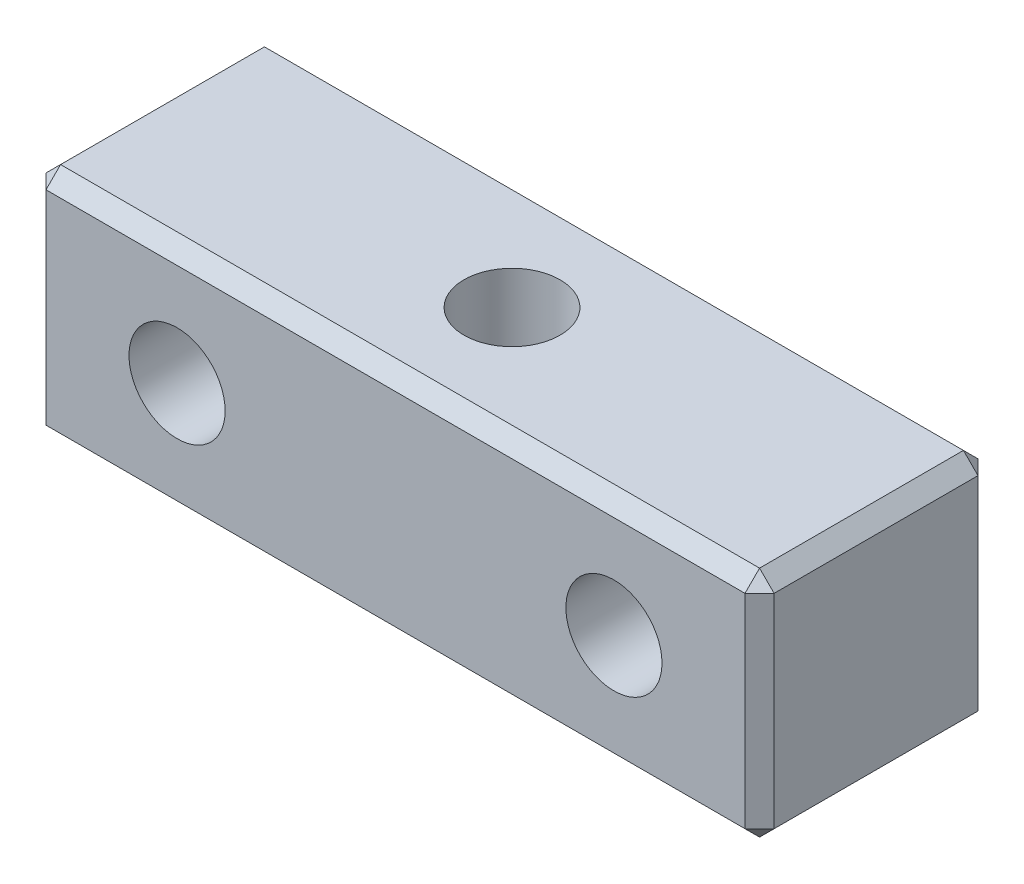
ISO-10303-21;
HEADER;
FILE_DESCRIPTION(('STEP AP214'),'2;1');
FILE_NAME('part.step','',(''),(''),'','','');
FILE_SCHEMA(('AUTOMOTIVE_DESIGN { 1 0 10303 214 1 1 1 1 }'));
ENDSEC;
DATA;
#1=APPLICATION_CONTEXT('core data for automotive mechanical design processes');
#2=APPLICATION_PROTOCOL_DEFINITION('international standard','automotive_design',2000,#1);
#3=PRODUCT_CONTEXT('',#1,'mechanical');
#4=PRODUCT('Part','Part','',(#3));
#5=PRODUCT_RELATED_PRODUCT_CATEGORY('part','',(#4));
#6=PRODUCT_DEFINITION_FORMATION('','',#4);
#7=PRODUCT_DEFINITION_CONTEXT('part definition',#1,'design');
#8=PRODUCT_DEFINITION('design','',#6,#7);
#9=PRODUCT_DEFINITION_SHAPE('','',#8);
#10=(LENGTH_UNIT() NAMED_UNIT(*) SI_UNIT(.MILLI.,.METRE.));
#11=(NAMED_UNIT(*) PLANE_ANGLE_UNIT() SI_UNIT($,.RADIAN.));
#12=(NAMED_UNIT(*) SI_UNIT($,.STERADIAN.) SOLID_ANGLE_UNIT());
#13=UNCERTAINTY_MEASURE_WITH_UNIT(LENGTH_MEASURE(1.E-05),#10,'distance_accuracy_value','');
#14=(GEOMETRIC_REPRESENTATION_CONTEXT(3) GLOBAL_UNCERTAINTY_ASSIGNED_CONTEXT((#13)) GLOBAL_UNIT_ASSIGNED_CONTEXT((#10,
#11,#12)) REPRESENTATION_CONTEXT('',''));
#15=CARTESIAN_POINT('',(0.,0.,0.));
#16=DIRECTION('',(0.,0.,1.));
#17=DIRECTION('',(1.,0.,0.));
#18=AXIS2_PLACEMENT_3D('',#15,#16,#17);
#19=CARTESIAN_POINT('',(12.5,-4.,8.));
#20=DIRECTION('',(-1.,0.,0.));
#21=DIRECTION('',(0.,0.,1.));
#22=AXIS2_PLACEMENT_3D('',#19,#20,#21);
#23=PLANE('',#22);
#24=DIRECTION('',(0.,0.,-1.));
#25=VECTOR('',#24,1.);
#26=CARTESIAN_POINT('',(12.5,-3.5,8.));
#27=LINE('',#26,#25);
#28=CARTESIAN_POINT('',(12.5,-3.5,7.5));
#29=VERTEX_POINT('',#28);
#30=CARTESIAN_POINT('',(12.5,-3.5,0.5));
#31=VERTEX_POINT('',#30);
#32=EDGE_CURVE('E186',#29,#31,#27,.T.);
#33=ORIENTED_EDGE('',*,*,#32,.T.);
#34=DIRECTION('',(0.,1.,0.));
#35=VECTOR('',#34,1.);
#36=CARTESIAN_POINT('',(12.5,4.,0.5));
#37=LINE('',#36,#35);
#38=CARTESIAN_POINT('',(12.5,3.5,0.5));
#39=VERTEX_POINT('',#38);
#40=EDGE_CURVE('E188',#31,#39,#37,.T.);
#41=ORIENTED_EDGE('',*,*,#40,.T.);
#42=DIRECTION('',(0.,0.,1.));
#43=VECTOR('',#42,1.);
#44=CARTESIAN_POINT('',(12.5,3.5,8.));
#45=LINE('',#44,#43);
#46=CARTESIAN_POINT('',(12.5,3.5,7.5));
#47=VERTEX_POINT('',#46);
#48=EDGE_CURVE('E182',#39,#47,#45,.T.);
#49=ORIENTED_EDGE('',*,*,#48,.T.);
#50=DIRECTION('',(0.,-1.,0.));
#51=VECTOR('',#50,1.);
#52=CARTESIAN_POINT('',(12.5,-4.,7.5));
#53=LINE('',#52,#51);
#54=EDGE_CURVE('E184',#47,#29,#53,.T.);
#55=ORIENTED_EDGE('',*,*,#54,.T.);
#56=EDGE_LOOP('',(#33,#41,#49,#55));
#57=FACE_BOUND('',#56,.T.);
#58=ADVANCED_FACE('F39',(#57),#23,.F.);
#59=CARTESIAN_POINT('',(-12.5,4.,8.));
#60=DIRECTION('',(0.,-1.,0.));
#61=DIRECTION('',(0.,0.,-1.));
#62=AXIS2_PLACEMENT_3D('',#59,#60,#61);
#63=PLANE('',#62);
#64=CARTESIAN_POINT('',(0.,4.,4.));
#65=DIRECTION('',(0.,-1.,0.));
#66=DIRECTION('',(0.,0.,-1.));
#67=AXIS2_PLACEMENT_3D('',#64,#65,#66);
#68=CIRCLE('',#67,1.65);
#69=CARTESIAN_POINT('',(0.,4.,2.35));
#70=VERTEX_POINT('',#69);
#71=EDGE_CURVE('E167',#70,#70,#68,.T.);
#72=ORIENTED_EDGE('',*,*,#71,.T.);
#73=EDGE_LOOP('',(#72));
#74=FACE_BOUND('',#73,.T.);
#75=DIRECTION('',(1.,0.,0.));
#76=VECTOR('',#75,1.);
#77=CARTESIAN_POINT('',(-12.5,4.,7.5));
#78=LINE('',#77,#76);
#79=CARTESIAN_POINT('',(-12.,4.,7.5));
#80=VERTEX_POINT('',#79);
#81=CARTESIAN_POINT('',(12.,4.,7.5));
#82=VERTEX_POINT('',#81);
#83=EDGE_CURVE('E49',#80,#82,#78,.T.);
#84=ORIENTED_EDGE('',*,*,#83,.T.);
#85=DIRECTION('',(0.,0.,-1.));
#86=VECTOR('',#85,1.);
#87=CARTESIAN_POINT('',(12.,4.,8.));
#88=LINE('',#87,#86);
#89=CARTESIAN_POINT('',(12.,4.,0.5));
#90=VERTEX_POINT('',#89);
#91=EDGE_CURVE('E11',#82,#90,#88,.T.);
#92=ORIENTED_EDGE('',*,*,#91,.T.);
#93=DIRECTION('',(-1.,0.,0.));
#94=VECTOR('',#93,1.);
#95=CARTESIAN_POINT('',(-12.5,4.,0.5));
#96=LINE('',#95,#94);
#97=CARTESIAN_POINT('',(-12.,4.,0.5));
#98=VERTEX_POINT('',#97);
#99=EDGE_CURVE('E208',#90,#98,#96,.T.);
#100=ORIENTED_EDGE('',*,*,#99,.T.);
#101=DIRECTION('',(0.,0.,1.));
#102=VECTOR('',#101,1.);
#103=CARTESIAN_POINT('',(-12.,4.,8.));
#104=LINE('',#103,#102);
#105=EDGE_CURVE('E60',#98,#80,#104,.T.);
#106=ORIENTED_EDGE('',*,*,#105,.T.);
#107=EDGE_LOOP('',(#84,#92,#100,#106));
#108=FACE_BOUND('',#107,.T.);
#109=ADVANCED_FACE('F321',(#74,#108),#63,.F.);
#110=CARTESIAN_POINT('',(-12.5,-4.,8.));
#111=DIRECTION('',(1.,0.,0.));
#112=DIRECTION('',(0.,0.,-1.));
#113=AXIS2_PLACEMENT_3D('',#110,#111,#112);
#114=PLANE('',#113);
#115=DIRECTION('',(0.,0.,-1.));
#116=VECTOR('',#115,1.);
#117=CARTESIAN_POINT('',(-12.5,3.5,8.));
#118=LINE('',#117,#116);
#119=CARTESIAN_POINT('',(-12.5,3.5,7.5));
#120=VERTEX_POINT('',#119);
#121=CARTESIAN_POINT('',(-12.5,3.5,0.5));
#122=VERTEX_POINT('',#121);
#123=EDGE_CURVE('E132',#120,#122,#118,.T.);
#124=ORIENTED_EDGE('',*,*,#123,.T.);
#125=DIRECTION('',(0.,-1.,0.));
#126=VECTOR('',#125,1.);
#127=CARTESIAN_POINT('',(-12.5,-4.,0.5));
#128=LINE('',#127,#126);
#129=CARTESIAN_POINT('',(-12.5,-3.5,0.5));
#130=VERTEX_POINT('',#129);
#131=EDGE_CURVE('E171',#122,#130,#128,.T.);
#132=ORIENTED_EDGE('',*,*,#131,.T.);
#133=DIRECTION('',(0.,0.,1.));
#134=VECTOR('',#133,1.);
#135=CARTESIAN_POINT('',(-12.5,-3.5,8.));
#136=LINE('',#135,#134);
#137=CARTESIAN_POINT('',(-12.5,-3.5,7.5));
#138=VERTEX_POINT('',#137);
#139=EDGE_CURVE('E135',#130,#138,#136,.T.);
#140=ORIENTED_EDGE('',*,*,#139,.T.);
#141=DIRECTION('',(0.,1.,0.));
#142=VECTOR('',#141,1.);
#143=CARTESIAN_POINT('',(-12.5,-4.,7.5));
#144=LINE('',#143,#142);
#145=EDGE_CURVE('E127',#138,#120,#144,.T.);
#146=ORIENTED_EDGE('',*,*,#145,.T.);
#147=EDGE_LOOP('',(#124,#132,#140,#146));
#148=FACE_BOUND('',#147,.T.);
#149=ADVANCED_FACE('F129',(#148),#114,.F.);
#150=CARTESIAN_POINT('',(-12.5,-4.,8.));
#151=DIRECTION('',(0.,1.,0.));
#152=DIRECTION('',(0.,0.,1.));
#153=AXIS2_PLACEMENT_3D('',#150,#151,#152);
#154=PLANE('',#153);
#155=CARTESIAN_POINT('',(0.,-4.,4.));
#156=DIRECTION('',(0.,-1.,0.));
#157=DIRECTION('',(0.,0.,-1.));
#158=AXIS2_PLACEMENT_3D('',#155,#156,#157);
#159=CIRCLE('',#158,1.64999999999999);
#160=CARTESIAN_POINT('',(0.,-4.,2.35000000000001));
#161=VERTEX_POINT('',#160);
#162=EDGE_CURVE('E638',#161,#161,#159,.T.);
#163=ORIENTED_EDGE('',*,*,#162,.F.);
#164=EDGE_LOOP('',(#163));
#165=FACE_BOUND('',#164,.T.);
#166=DIRECTION('',(-1.,0.,0.));
#167=VECTOR('',#166,1.);
#168=CARTESIAN_POINT('',(-12.5,-4.,7.5));
#169=LINE('',#168,#167);
#170=CARTESIAN_POINT('',(12.,-4.,7.5));
#171=VERTEX_POINT('',#170);
#172=CARTESIAN_POINT('',(-12.,-4.,7.5));
#173=VERTEX_POINT('',#172);
#174=EDGE_CURVE('E191',#171,#173,#169,.T.);
#175=ORIENTED_EDGE('',*,*,#174,.T.);
#176=DIRECTION('',(0.,0.,-1.));
#177=VECTOR('',#176,1.);
#178=CARTESIAN_POINT('',(-12.,-4.,8.));
#179=LINE('',#178,#177);
#180=CARTESIAN_POINT('',(-12.,-4.,0.5));
#181=VERTEX_POINT('',#180);
#182=EDGE_CURVE('E197',#173,#181,#179,.T.);
#183=ORIENTED_EDGE('',*,*,#182,.T.);
#184=DIRECTION('',(1.,0.,0.));
#185=VECTOR('',#184,1.);
#186=CARTESIAN_POINT('',(12.5,-4.,0.5));
#187=LINE('',#186,#185);
#188=CARTESIAN_POINT('',(12.,-4.,0.5));
#189=VERTEX_POINT('',#188);
#190=EDGE_CURVE('E195',#181,#189,#187,.T.);
#191=ORIENTED_EDGE('',*,*,#190,.T.);
#192=DIRECTION('',(0.,0.,1.));
#193=VECTOR('',#192,1.);
#194=CARTESIAN_POINT('',(12.,-4.,8.));
#195=LINE('',#194,#193);
#196=EDGE_CURVE('E193',#189,#171,#195,.T.);
#197=ORIENTED_EDGE('',*,*,#196,.T.);
#198=EDGE_LOOP('',(#175,#183,#191,#197));
#199=FACE_BOUND('',#198,.T.);
#200=ADVANCED_FACE('F285',(#165,#199),#154,.F.);
#201=CARTESIAN_POINT('',(0.,0.,8.));
#202=DIRECTION('',(0.,0.,-1.));
#203=DIRECTION('',(-1.,0.,0.));
#204=AXIS2_PLACEMENT_3D('',#201,#202,#203);
#205=PLANE('',#204);
#206=CARTESIAN_POINT('',(-7.5,0.,8.));
#207=DIRECTION('',(0.,0.,1.));
#208=DIRECTION('',(1.,0.,0.));
#209=AXIS2_PLACEMENT_3D('',#206,#207,#208);
#210=CIRCLE('',#209,1.64999999999999);
#211=CARTESIAN_POINT('',(-5.85000000000001,0.,8.));
#212=VERTEX_POINT('',#211);
#213=EDGE_CURVE('E648',#212,#212,#210,.T.);
#214=ORIENTED_EDGE('',*,*,#213,.F.);
#215=EDGE_LOOP('',(#214));
#216=FACE_BOUND('',#215,.T.);
#217=CARTESIAN_POINT('',(7.5,0.,8.));
#218=DIRECTION('',(0.,0.,1.));
#219=DIRECTION('',(1.,0.,0.));
#220=AXIS2_PLACEMENT_3D('',#217,#218,#219);
#221=CIRCLE('',#220,1.64999999999999);
#222=CARTESIAN_POINT('',(9.14999999999999,0.,8.));
#223=VERTEX_POINT('',#222);
#224=EDGE_CURVE('E641',#223,#223,#221,.T.);
#225=ORIENTED_EDGE('',*,*,#224,.F.);
#226=EDGE_LOOP('',(#225));
#227=FACE_BOUND('',#226,.T.);
#228=DIRECTION('',(0.,-1.,0.));
#229=VECTOR('',#228,1.);
#230=CARTESIAN_POINT('',(-12.,0.,8.));
#231=LINE('',#230,#229);
#232=CARTESIAN_POINT('',(-12.,3.5,8.));
#233=VERTEX_POINT('',#232);
#234=CARTESIAN_POINT('',(-12.,-3.5,8.));
#235=VERTEX_POINT('',#234);
#236=EDGE_CURVE('E145',#233,#235,#231,.T.);
#237=ORIENTED_EDGE('',*,*,#236,.T.);
#238=DIRECTION('',(1.,0.,0.));
#239=VECTOR('',#238,1.);
#240=CARTESIAN_POINT('',(0.,-3.5,8.));
#241=LINE('',#240,#239);
#242=CARTESIAN_POINT('',(12.,-3.5,8.));
#243=VERTEX_POINT('',#242);
#244=EDGE_CURVE('E205',#235,#243,#241,.T.);
#245=ORIENTED_EDGE('',*,*,#244,.T.);
#246=DIRECTION('',(0.,1.,0.));
#247=VECTOR('',#246,1.);
#248=CARTESIAN_POINT('',(12.,0.,8.));
#249=LINE('',#248,#247);
#250=CARTESIAN_POINT('',(12.,3.5,8.));
#251=VERTEX_POINT('',#250);
#252=EDGE_CURVE('E202',#243,#251,#249,.T.);
#253=ORIENTED_EDGE('',*,*,#252,.T.);
#254=DIRECTION('',(-1.,0.,0.));
#255=VECTOR('',#254,1.);
#256=CARTESIAN_POINT('',(0.,3.5,8.));
#257=LINE('',#256,#255);
#258=EDGE_CURVE('E200',#251,#233,#257,.T.);
#259=ORIENTED_EDGE('',*,*,#258,.T.);
#260=EDGE_LOOP('',(#237,#245,#253,#259));
#261=FACE_BOUND('',#260,.T.);
#262=ADVANCED_FACE('F272',(#216,#227,#261),#205,.F.);
#263=CARTESIAN_POINT('',(0.,0.,0.));
#264=DIRECTION('',(0.,0.,-1.));
#265=DIRECTION('',(-1.,0.,0.));
#266=AXIS2_PLACEMENT_3D('',#263,#264,#265);
#267=PLANE('',#266);
#268=CARTESIAN_POINT('',(-7.5,0.,0.));
#269=DIRECTION('',(0.,0.,1.));
#270=DIRECTION('',(1.,0.,0.));
#271=AXIS2_PLACEMENT_3D('',#268,#269,#270);
#272=CIRCLE('',#271,1.65);
#273=CARTESIAN_POINT('',(-5.85,0.,0.));
#274=VERTEX_POINT('',#273);
#275=EDGE_CURVE('E646',#274,#274,#272,.T.);
#276=ORIENTED_EDGE('',*,*,#275,.T.);
#277=EDGE_LOOP('',(#276));
#278=FACE_BOUND('',#277,.T.);
#279=CARTESIAN_POINT('',(7.5,0.,0.));
#280=DIRECTION('',(0.,0.,1.));
#281=DIRECTION('',(1.,0.,0.));
#282=AXIS2_PLACEMENT_3D('',#279,#280,#281);
#283=CIRCLE('',#282,1.65);
#284=CARTESIAN_POINT('',(9.15,0.,0.));
#285=VERTEX_POINT('',#284);
#286=EDGE_CURVE('E639',#285,#285,#283,.T.);
#287=ORIENTED_EDGE('',*,*,#286,.T.);
#288=EDGE_LOOP('',(#287));
#289=FACE_BOUND('',#288,.T.);
#290=DIRECTION('',(0.,-1.,0.));
#291=VECTOR('',#290,1.);
#292=CARTESIAN_POINT('',(12.,-4.,0.));
#293=LINE('',#292,#291);
#294=CARTESIAN_POINT('',(12.,3.5,0.));
#295=VERTEX_POINT('',#294);
#296=CARTESIAN_POINT('',(12.,-3.5,0.));
#297=VERTEX_POINT('',#296);
#298=EDGE_CURVE('E175',#295,#297,#293,.T.);
#299=ORIENTED_EDGE('',*,*,#298,.T.);
#300=DIRECTION('',(-1.,0.,0.));
#301=VECTOR('',#300,1.);
#302=CARTESIAN_POINT('',(-12.5,-3.5,0.));
#303=LINE('',#302,#301);
#304=CARTESIAN_POINT('',(-12.,-3.5,0.));
#305=VERTEX_POINT('',#304);
#306=EDGE_CURVE('E180',#297,#305,#303,.T.);
#307=ORIENTED_EDGE('',*,*,#306,.T.);
#308=DIRECTION('',(0.,1.,0.));
#309=VECTOR('',#308,1.);
#310=CARTESIAN_POINT('',(-12.,4.,0.));
#311=LINE('',#310,#309);
#312=CARTESIAN_POINT('',(-12.,3.5,0.));
#313=VERTEX_POINT('',#312);
#314=EDGE_CURVE('E177',#305,#313,#311,.T.);
#315=ORIENTED_EDGE('',*,*,#314,.T.);
#316=DIRECTION('',(1.,0.,0.));
#317=VECTOR('',#316,1.);
#318=CARTESIAN_POINT('',(12.5,3.5,0.));
#319=LINE('',#318,#317);
#320=EDGE_CURVE('E173',#313,#295,#319,.T.);
#321=ORIENTED_EDGE('',*,*,#320,.T.);
#322=EDGE_LOOP('',(#299,#307,#315,#321));
#323=FACE_BOUND('',#322,.T.);
#324=ADVANCED_FACE('F435',(#278,#289,#323),#267,.T.);
#325=CARTESIAN_POINT('',(12.,0.,8.));
#326=DIRECTION('',(-0.70710678118655,0.,-0.707106781186545));
#327=DIRECTION('',(0.,1.,0.));
#328=AXIS2_PLACEMENT_3D('',#325,#326,#327);
#329=PLANE('',#328);
#330=DIRECTION('',(-0.707106781186545,0.,0.70710678118655));
#331=VECTOR('',#330,1.);
#332=CARTESIAN_POINT('',(12.,3.5,8.));
#333=LINE('',#332,#331);
#334=EDGE_CURVE('E44',#251,#47,#333,.F.);
#335=ORIENTED_EDGE('',*,*,#334,.F.);
#336=ORIENTED_EDGE('',*,*,#252,.F.);
#337=DIRECTION('',(0.707106781186545,0.,-0.70710678118655));
#338=VECTOR('',#337,1.);
#339=CARTESIAN_POINT('',(12.25,-3.5,7.75));
#340=LINE('',#339,#338);
#341=EDGE_CURVE('E165',#29,#243,#340,.F.);
#342=ORIENTED_EDGE('',*,*,#341,.F.);
#343=ORIENTED_EDGE('',*,*,#54,.F.);
#344=EDGE_LOOP('',(#335,#336,#342,#343));
#345=FACE_BOUND('',#344,.T.);
#346=ADVANCED_FACE('F42',(#345),#329,.F.);
#347=CARTESIAN_POINT('',(12.,3.5,8.));
#348=DIRECTION('',(0.57735026918963,0.577350269189622,0.577350269189626));
#349=DIRECTION('',(0.707106781186545,0.,-0.70710678118655));
#350=AXIS2_PLACEMENT_3D('',#347,#348,#349);
#351=PLANE('',#350);
#352=DIRECTION('',(0.,0.70710678118655,-0.707106781186545));
#353=VECTOR('',#352,1.);
#354=CARTESIAN_POINT('',(12.,3.5,8.));
#355=LINE('',#354,#353);
#356=EDGE_CURVE('E253',#251,#82,#355,.T.);
#357=ORIENTED_EDGE('',*,*,#356,.F.);
#358=ORIENTED_EDGE('',*,*,#334,.T.);
#359=DIRECTION('',(0.707106781186545,-0.70710678118655,0.));
#360=VECTOR('',#359,1.);
#361=CARTESIAN_POINT('',(12.25,3.75,7.5));
#362=LINE('',#361,#360);
#363=EDGE_CURVE('E255',#82,#47,#362,.T.);
#364=ORIENTED_EDGE('',*,*,#363,.F.);
#365=EDGE_LOOP('',(#357,#358,#364));
#366=FACE_BOUND('',#365,.T.);
#367=ADVANCED_FACE('F307',(#366),#351,.T.);
#368=CARTESIAN_POINT('',(12.,-4.,7.5));
#369=DIRECTION('',(0.577350269189626,-0.57735026918963,0.577350269189622));
#370=DIRECTION('',(0.70710678118655,0.707106781186545,0.));
#371=AXIS2_PLACEMENT_3D('',#368,#369,#370);
#372=PLANE('',#371);
#373=DIRECTION('',(-0.70710678118655,-0.707106781186545,0.));
#374=VECTOR('',#373,1.);
#375=CARTESIAN_POINT('',(12.,-4.,7.5));
#376=LINE('',#375,#374);
#377=EDGE_CURVE('E248',#29,#171,#376,.T.);
#378=ORIENTED_EDGE('',*,*,#377,.F.);
#379=ORIENTED_EDGE('',*,*,#341,.T.);
#380=DIRECTION('',(0.,0.707106781186545,0.70710678118655));
#381=VECTOR('',#380,1.);
#382=CARTESIAN_POINT('',(12.,-4.,7.5));
#383=LINE('',#382,#381);
#384=EDGE_CURVE('E251',#171,#243,#383,.T.);
#385=ORIENTED_EDGE('',*,*,#384,.F.);
#386=EDGE_LOOP('',(#378,#379,#385));
#387=FACE_BOUND('',#386,.T.);
#388=ADVANCED_FACE('F263',(#387),#372,.T.);
#389=CARTESIAN_POINT('',(12.,4.,8.));
#390=DIRECTION('',(-0.70710678118655,-0.707106781186545,0.));
#391=DIRECTION('',(0.,0.,-1.));
#392=AXIS2_PLACEMENT_3D('',#389,#390,#391);
#393=PLANE('',#392);
#394=ORIENTED_EDGE('',*,*,#363,.T.);
#395=ORIENTED_EDGE('',*,*,#48,.F.);
#396=DIRECTION('',(-0.707106781186545,0.70710678118655,0.));
#397=VECTOR('',#396,1.);
#398=CARTESIAN_POINT('',(12.5,3.5,0.5));
#399=LINE('',#398,#397);
#400=EDGE_CURVE('E243',#90,#39,#399,.F.);
#401=ORIENTED_EDGE('',*,*,#400,.F.);
#402=ORIENTED_EDGE('',*,*,#91,.F.);
#403=EDGE_LOOP('',(#394,#395,#401,#402));
#404=FACE_BOUND('',#403,.T.);
#405=ADVANCED_FACE('F303',(#404),#393,.F.);
#406=CARTESIAN_POINT('',(0.,3.5,8.));
#407=DIRECTION('',(0.,-0.707106781186545,-0.70710678118655));
#408=DIRECTION('',(-1.,0.,0.));
#409=AXIS2_PLACEMENT_3D('',#406,#407,#408);
#410=PLANE('',#409);
#411=ORIENTED_EDGE('',*,*,#356,.T.);
#412=ORIENTED_EDGE('',*,*,#83,.F.);
#413=DIRECTION('',(0.,-0.70710678118655,0.707106781186545));
#414=VECTOR('',#413,1.);
#415=CARTESIAN_POINT('',(-12.,3.75,7.75));
#416=LINE('',#415,#414);
#417=EDGE_CURVE('E149',#233,#80,#416,.F.);
#418=ORIENTED_EDGE('',*,*,#417,.F.);
#419=ORIENTED_EDGE('',*,*,#258,.F.);
#420=EDGE_LOOP('',(#411,#412,#418,#419));
#421=FACE_BOUND('',#420,.T.);
#422=ADVANCED_FACE('F310',(#421),#410,.F.);
#423=CARTESIAN_POINT('',(-12.,0.,8.));
#424=DIRECTION('',(0.70710678118655,0.,-0.707106781186545));
#425=DIRECTION('',(0.,-1.,0.));
#426=AXIS2_PLACEMENT_3D('',#423,#424,#425);
#427=PLANE('',#426);
#428=DIRECTION('',(0.707106781186545,0.,0.70710678118655));
#429=VECTOR('',#428,1.);
#430=CARTESIAN_POINT('',(-12.5,-3.5,7.5));
#431=LINE('',#430,#429);
#432=EDGE_CURVE('E150',#235,#138,#431,.F.);
#433=ORIENTED_EDGE('',*,*,#432,.F.);
#434=ORIENTED_EDGE('',*,*,#236,.F.);
#435=DIRECTION('',(-0.707106781186545,0.,-0.70710678118655));
#436=VECTOR('',#435,1.);
#437=CARTESIAN_POINT('',(-12.5,3.5,7.5));
#438=LINE('',#437,#436);
#439=EDGE_CURVE('E142',#120,#233,#438,.F.);
#440=ORIENTED_EDGE('',*,*,#439,.F.);
#441=ORIENTED_EDGE('',*,*,#145,.F.);
#442=EDGE_LOOP('',(#433,#434,#440,#441));
#443=FACE_BOUND('',#442,.T.);
#444=ADVANCED_FACE('F144',(#443),#427,.F.);
#445=CARTESIAN_POINT('',(0.,-3.5,8.));
#446=DIRECTION('',(0.,0.70710678118655,-0.707106781186545));
#447=DIRECTION('',(1.,0.,0.));
#448=AXIS2_PLACEMENT_3D('',#445,#446,#447);
#449=PLANE('',#448);
#450=ORIENTED_EDGE('',*,*,#384,.T.);
#451=ORIENTED_EDGE('',*,*,#244,.F.);
#452=DIRECTION('',(0.,-0.707106781186545,-0.70710678118655));
#453=VECTOR('',#452,1.);
#454=CARTESIAN_POINT('',(-12.,-3.75,7.75));
#455=LINE('',#454,#453);
#456=EDGE_CURVE('E238',#173,#235,#455,.F.);
#457=ORIENTED_EDGE('',*,*,#456,.F.);
#458=ORIENTED_EDGE('',*,*,#174,.F.);
#459=EDGE_LOOP('',(#450,#451,#457,#458));
#460=FACE_BOUND('',#459,.T.);
#461=ADVANCED_FACE('F275',(#460),#449,.F.);
#462=CARTESIAN_POINT('',(12.5,-3.5,8.));
#463=DIRECTION('',(-0.707106781186545,0.70710678118655,0.));
#464=DIRECTION('',(0.,0.,-1.));
#465=AXIS2_PLACEMENT_3D('',#462,#463,#464);
#466=PLANE('',#465);
#467=ORIENTED_EDGE('',*,*,#377,.T.);
#468=ORIENTED_EDGE('',*,*,#196,.F.);
#469=DIRECTION('',(0.70710678118655,0.707106781186545,0.));
#470=VECTOR('',#469,1.);
#471=CARTESIAN_POINT('',(12.25,-3.75,0.5));
#472=LINE('',#471,#470);
#473=EDGE_CURVE('E235',#31,#189,#472,.F.);
#474=ORIENTED_EDGE('',*,*,#473,.F.);
#475=ORIENTED_EDGE('',*,*,#32,.F.);
#476=EDGE_LOOP('',(#467,#468,#474,#475));
#477=FACE_BOUND('',#476,.T.);
#478=ADVANCED_FACE('F289',(#477),#466,.F.);
#479=CARTESIAN_POINT('',(12.5,-4.,0.5));
#480=DIRECTION('',(0.707106781186545,0.,-0.70710678118655));
#481=DIRECTION('',(0.,-1.,0.));
#482=AXIS2_PLACEMENT_3D('',#479,#480,#481);
#483=PLANE('',#482);
#484=DIRECTION('',(-0.70710678118655,0.,-0.707106781186545));
#485=VECTOR('',#484,1.);
#486=CARTESIAN_POINT('',(12.5,3.5,0.5));
#487=LINE('',#486,#485);
#488=EDGE_CURVE('E245',#39,#295,#487,.T.);
#489=ORIENTED_EDGE('',*,*,#488,.F.);
#490=ORIENTED_EDGE('',*,*,#40,.F.);
#491=DIRECTION('',(0.70710678118655,0.,0.707106781186545));
#492=VECTOR('',#491,1.);
#493=CARTESIAN_POINT('',(12.,-3.5,0.));
#494=LINE('',#493,#492);
#495=EDGE_CURVE('E232',#297,#31,#494,.T.);
#496=ORIENTED_EDGE('',*,*,#495,.F.);
#497=ORIENTED_EDGE('',*,*,#298,.F.);
#498=EDGE_LOOP('',(#489,#490,#496,#497));
#499=FACE_BOUND('',#498,.T.);
#500=ADVANCED_FACE('F295',(#499),#483,.T.);
#501=CARTESIAN_POINT('',(12.5,3.5,0.5));
#502=DIRECTION('',(0.577350269189626,0.577350269189622,-0.57735026918963));
#503=DIRECTION('',(-0.70710678118655,0.,-0.707106781186545));
#504=AXIS2_PLACEMENT_3D('',#501,#502,#503);
#505=PLANE('',#504);
#506=ORIENTED_EDGE('',*,*,#400,.T.);
#507=ORIENTED_EDGE('',*,*,#488,.T.);
#508=DIRECTION('',(0.,0.70710678118655,0.707106781186545));
#509=VECTOR('',#508,1.);
#510=CARTESIAN_POINT('',(12.,3.75,0.25));
#511=LINE('',#510,#509);
#512=EDGE_CURVE('E156',#90,#295,#511,.F.);
#513=ORIENTED_EDGE('',*,*,#512,.F.);
#514=EDGE_LOOP('',(#506,#507,#513));
#515=FACE_BOUND('',#514,.T.);
#516=ADVANCED_FACE('F394',(#515),#505,.T.);
#517=CARTESIAN_POINT('',(-12.5,3.5,7.5));
#518=DIRECTION('',(-0.57735026918963,0.577350269189622,0.577350269189626));
#519=DIRECTION('',(0.707106781186545,0.,0.70710678118655));
#520=AXIS2_PLACEMENT_3D('',#517,#518,#519);
#521=PLANE('',#520);
#522=ORIENTED_EDGE('',*,*,#439,.T.);
#523=ORIENTED_EDGE('',*,*,#417,.T.);
#524=DIRECTION('',(0.707106781186545,0.70710678118655,0.));
#525=VECTOR('',#524,1.);
#526=CARTESIAN_POINT('',(-12.5,3.5,7.5));
#527=LINE('',#526,#525);
#528=EDGE_CURVE('E153',#120,#80,#527,.T.);
#529=ORIENTED_EDGE('',*,*,#528,.F.);
#530=EDGE_LOOP('',(#522,#523,#529));
#531=FACE_BOUND('',#530,.T.);
#532=ADVANCED_FACE('F154',(#531),#521,.T.);
#533=CARTESIAN_POINT('',(-12.5,-3.5,7.5));
#534=DIRECTION('',(-0.57735026918963,-0.577350269189626,0.577350269189622));
#535=DIRECTION('',(0.707106781186545,-0.70710678118655,0.));
#536=AXIS2_PLACEMENT_3D('',#533,#534,#535);
#537=PLANE('',#536);
#538=ORIENTED_EDGE('',*,*,#456,.T.);
#539=ORIENTED_EDGE('',*,*,#432,.T.);
#540=DIRECTION('',(-0.707106781186545,0.70710678118655,0.));
#541=VECTOR('',#540,1.);
#542=CARTESIAN_POINT('',(-12.5,-3.5,7.5));
#543=LINE('',#542,#541);
#544=EDGE_CURVE('E157',#173,#138,#543,.T.);
#545=ORIENTED_EDGE('',*,*,#544,.F.);
#546=EDGE_LOOP('',(#538,#539,#545));
#547=FACE_BOUND('',#546,.T.);
#548=ADVANCED_FACE('F278',(#547),#537,.T.);
#549=CARTESIAN_POINT('',(12.,-3.5,0.));
#550=DIRECTION('',(0.577350269189622,-0.577350269189626,-0.57735026918963));
#551=DIRECTION('',(0.,0.70710678118655,-0.707106781186545));
#552=AXIS2_PLACEMENT_3D('',#549,#550,#551);
#553=PLANE('',#552);
#554=ORIENTED_EDGE('',*,*,#495,.T.);
#555=ORIENTED_EDGE('',*,*,#473,.T.);
#556=DIRECTION('',(0.,0.70710678118655,-0.707106781186545));
#557=VECTOR('',#556,1.);
#558=CARTESIAN_POINT('',(12.,-3.5,0.));
#559=LINE('',#558,#557);
#560=EDGE_CURVE('E225',#297,#189,#559,.F.);
#561=ORIENTED_EDGE('',*,*,#560,.F.);
#562=EDGE_LOOP('',(#554,#555,#561));
#563=FACE_BOUND('',#562,.T.);
#564=ADVANCED_FACE('F376',(#563),#553,.T.);
#565=CARTESIAN_POINT('',(-12.5,4.,0.5));
#566=DIRECTION('',(0.,0.707106781186545,-0.70710678118655));
#567=DIRECTION('',(1.,0.,0.));
#568=AXIS2_PLACEMENT_3D('',#565,#566,#567);
#569=PLANE('',#568);
#570=ORIENTED_EDGE('',*,*,#512,.T.);
#571=ORIENTED_EDGE('',*,*,#320,.F.);
#572=DIRECTION('',(0.,-0.70710678118655,-0.707106781186545));
#573=VECTOR('',#572,1.);
#574=CARTESIAN_POINT('',(-12.,3.5,0.));
#575=LINE('',#574,#573);
#576=EDGE_CURVE('E222',#98,#313,#575,.T.);
#577=ORIENTED_EDGE('',*,*,#576,.F.);
#578=ORIENTED_EDGE('',*,*,#99,.F.);
#579=EDGE_LOOP('',(#570,#571,#577,#578));
#580=FACE_BOUND('',#579,.T.);
#581=ADVANCED_FACE('F370',(#580),#569,.T.);
#582=CARTESIAN_POINT('',(-12.5,3.5,8.));
#583=DIRECTION('',(0.70710678118655,-0.707106781186545,0.));
#584=DIRECTION('',(0.,0.,-1.));
#585=AXIS2_PLACEMENT_3D('',#582,#583,#584);
#586=PLANE('',#585);
#587=ORIENTED_EDGE('',*,*,#528,.T.);
#588=ORIENTED_EDGE('',*,*,#105,.F.);
#589=DIRECTION('',(-0.707106781186545,-0.70710678118655,0.));
#590=VECTOR('',#589,1.);
#591=CARTESIAN_POINT('',(-12.25,3.75,0.5));
#592=LINE('',#591,#590);
#593=EDGE_CURVE('E161',#122,#98,#592,.F.);
#594=ORIENTED_EDGE('',*,*,#593,.F.);
#595=ORIENTED_EDGE('',*,*,#123,.F.);
#596=EDGE_LOOP('',(#587,#588,#594,#595));
#597=FACE_BOUND('',#596,.T.);
#598=ADVANCED_FACE('F159',(#597),#586,.F.);
#599=CARTESIAN_POINT('',(-12.,-4.,8.));
#600=DIRECTION('',(0.70710678118655,0.707106781186545,0.));
#601=DIRECTION('',(0.,0.,-1.));
#602=AXIS2_PLACEMENT_3D('',#599,#600,#601);
#603=PLANE('',#602);
#604=ORIENTED_EDGE('',*,*,#544,.T.);
#605=ORIENTED_EDGE('',*,*,#139,.F.);
#606=DIRECTION('',(0.707106781186545,-0.70710678118655,0.));
#607=VECTOR('',#606,1.);
#608=CARTESIAN_POINT('',(-12.5,-3.5,0.5));
#609=LINE('',#608,#607);
#610=EDGE_CURVE('E218',#181,#130,#609,.F.);
#611=ORIENTED_EDGE('',*,*,#610,.F.);
#612=ORIENTED_EDGE('',*,*,#182,.F.);
#613=EDGE_LOOP('',(#604,#605,#611,#612));
#614=FACE_BOUND('',#613,.T.);
#615=ADVANCED_FACE('F282',(#614),#603,.F.);
#616=CARTESIAN_POINT('',(-12.5,-4.,0.5));
#617=DIRECTION('',(0.,-0.707106781186545,-0.70710678118655));
#618=DIRECTION('',(-1.,0.,0.));
#619=AXIS2_PLACEMENT_3D('',#616,#617,#618);
#620=PLANE('',#619);
#621=ORIENTED_EDGE('',*,*,#560,.T.);
#622=ORIENTED_EDGE('',*,*,#190,.F.);
#623=DIRECTION('',(0.,-0.70710678118655,0.707106781186545));
#624=VECTOR('',#623,1.);
#625=CARTESIAN_POINT('',(-12.,-3.75,0.25));
#626=LINE('',#625,#624);
#627=EDGE_CURVE('E216',#305,#181,#626,.T.);
#628=ORIENTED_EDGE('',*,*,#627,.F.);
#629=ORIENTED_EDGE('',*,*,#306,.F.);
#630=EDGE_LOOP('',(#621,#622,#628,#629));
#631=FACE_BOUND('',#630,.T.);
#632=ADVANCED_FACE('F352',(#631),#620,.T.);
#633=CARTESIAN_POINT('',(-12.,3.5,0.));
#634=DIRECTION('',(-0.577350269189626,0.577350269189622,-0.57735026918963));
#635=DIRECTION('',(-0.70710678118655,0.,0.707106781186545));
#636=AXIS2_PLACEMENT_3D('',#633,#634,#635);
#637=PLANE('',#636);
#638=ORIENTED_EDGE('',*,*,#593,.T.);
#639=ORIENTED_EDGE('',*,*,#576,.T.);
#640=DIRECTION('',(-0.70710678118655,0.,0.707106781186545));
#641=VECTOR('',#640,1.);
#642=CARTESIAN_POINT('',(-12.,3.5,0.));
#643=LINE('',#642,#641);
#644=EDGE_CURVE('E214',#122,#313,#643,.F.);
#645=ORIENTED_EDGE('',*,*,#644,.F.);
#646=EDGE_LOOP('',(#638,#639,#645));
#647=FACE_BOUND('',#646,.T.);
#648=ADVANCED_FACE('F345',(#647),#637,.T.);
#649=CARTESIAN_POINT('',(-12.5,-3.5,0.5));
#650=DIRECTION('',(-0.577350269189626,-0.577350269189622,-0.57735026918963));
#651=DIRECTION('',(-0.70710678118655,0.,0.707106781186545));
#652=AXIS2_PLACEMENT_3D('',#649,#650,#651);
#653=PLANE('',#652);
#654=ORIENTED_EDGE('',*,*,#627,.T.);
#655=ORIENTED_EDGE('',*,*,#610,.T.);
#656=DIRECTION('',(0.70710678118655,0.,-0.707106781186545));
#657=VECTOR('',#656,1.);
#658=CARTESIAN_POINT('',(-12.5,-3.5,0.5));
#659=LINE('',#658,#657);
#660=EDGE_CURVE('E212',#305,#130,#659,.F.);
#661=ORIENTED_EDGE('',*,*,#660,.F.);
#662=EDGE_LOOP('',(#654,#655,#661));
#663=FACE_BOUND('',#662,.T.);
#664=ADVANCED_FACE('F338',(#663),#653,.T.);
#665=CARTESIAN_POINT('',(-12.5,-4.,0.5));
#666=DIRECTION('',(-0.707106781186545,0.,-0.70710678118655));
#667=DIRECTION('',(0.,1.,0.));
#668=AXIS2_PLACEMENT_3D('',#665,#666,#667);
#669=PLANE('',#668);
#670=ORIENTED_EDGE('',*,*,#644,.T.);
#671=ORIENTED_EDGE('',*,*,#314,.F.);
#672=ORIENTED_EDGE('',*,*,#660,.T.);
#673=ORIENTED_EDGE('',*,*,#131,.F.);
#674=EDGE_LOOP('',(#670,#671,#672,#673));
#675=FACE_BOUND('',#674,.T.);
#676=ADVANCED_FACE('F331',(#675),#669,.T.);
#677=CARTESIAN_POINT('',(0.,-4.,4.));
#678=DIRECTION('',(0.,-1.,0.));
#679=DIRECTION('',(0.,0.,-1.));
#680=AXIS2_PLACEMENT_3D('',#677,#678,#679);
#681=CYLINDRICAL_SURFACE('',#680,1.64999999999999);
#682=ORIENTED_EDGE('',*,*,#71,.F.);
#683=EDGE_LOOP('',(#682));
#684=FACE_BOUND('',#683,.T.);
#685=ORIENTED_EDGE('',*,*,#162,.T.);
#686=EDGE_LOOP('',(#685));
#687=FACE_BOUND('',#686,.T.);
#688=ADVANCED_FACE('F337',(#684,#687),#681,.F.);
#689=CARTESIAN_POINT('',(7.5,0.,8.));
#690=DIRECTION('',(0.,0.,1.));
#691=DIRECTION('',(1.,0.,0.));
#692=AXIS2_PLACEMENT_3D('',#689,#690,#691);
#693=CYLINDRICAL_SURFACE('',#692,1.64999999999999);
#694=ORIENTED_EDGE('',*,*,#286,.F.);
#695=EDGE_LOOP('',(#694));
#696=FACE_BOUND('',#695,.T.);
#697=ORIENTED_EDGE('',*,*,#224,.T.);
#698=EDGE_LOOP('',(#697));
#699=FACE_BOUND('',#698,.T.);
#700=ADVANCED_FACE('F479',(#696,#699),#693,.F.);
#701=CARTESIAN_POINT('',(-7.5,0.,8.));
#702=DIRECTION('',(0.,0.,1.));
#703=DIRECTION('',(1.,0.,0.));
#704=AXIS2_PLACEMENT_3D('',#701,#702,#703);
#705=CYLINDRICAL_SURFACE('',#704,1.64999999999999);
#706=ORIENTED_EDGE('',*,*,#275,.F.);
#707=EDGE_LOOP('',(#706));
#708=FACE_BOUND('',#707,.T.);
#709=ORIENTED_EDGE('',*,*,#213,.T.);
#710=EDGE_LOOP('',(#709));
#711=FACE_BOUND('',#710,.T.);
#712=ADVANCED_FACE('F485',(#708,#711),#705,.F.);
#713=CLOSED_SHELL('',(#58,#109,#149,#200,#262,#324,#346,#367,#388,#405,#422,#444,#461,#478,#500,
#516,#532,#548,#564,#581,#598,#615,#632,#648,#664,#676,#688,#700,#712));
#714=MANIFOLD_SOLID_BREP('B2',#713);
#715=ADVANCED_BREP_SHAPE_REPRESENTATION('',(#18,#714),#14);
#716=SHAPE_DEFINITION_REPRESENTATION(#9,#715);
ENDSEC;
END-ISO-10303-21;
